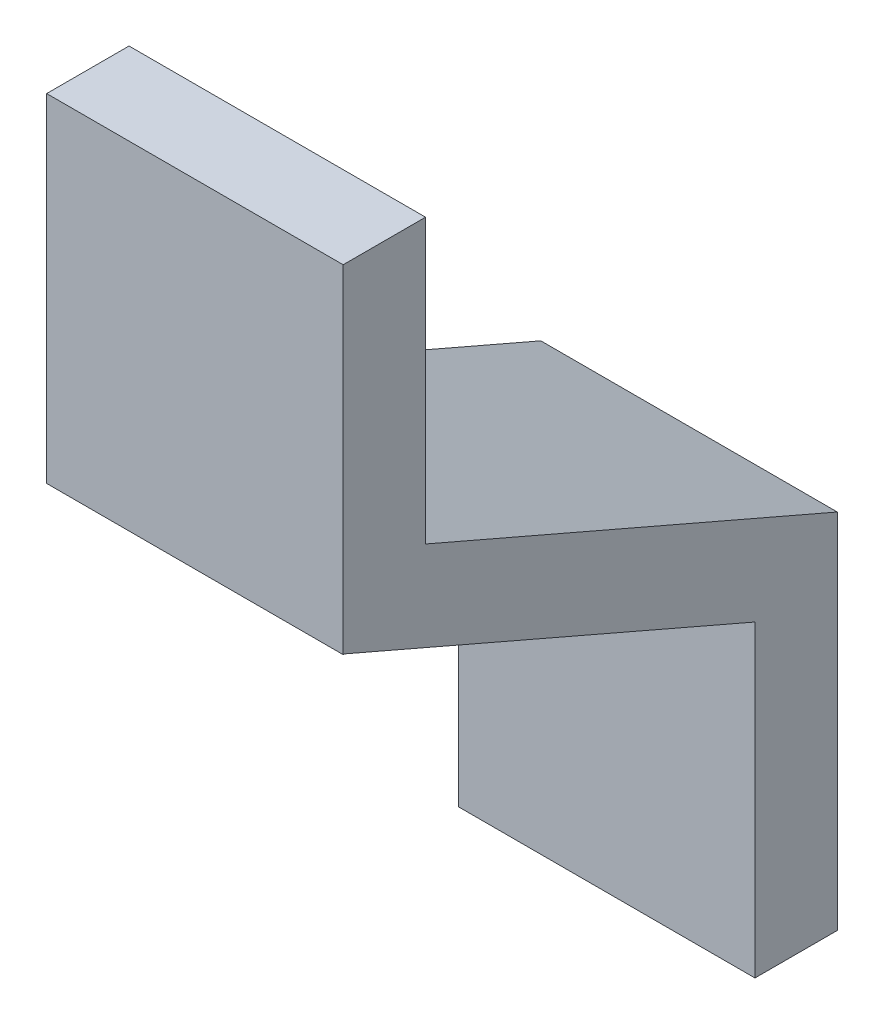
ISO-10303-21;
HEADER;
FILE_DESCRIPTION(('STEP AP214'),'2;1');
FILE_NAME('part.step','',(''),(''),'','','');
FILE_SCHEMA(('AUTOMOTIVE_DESIGN { 1 0 10303 214 1 1 1 1 }'));
ENDSEC;
DATA;
#1=APPLICATION_CONTEXT('core data for automotive mechanical design processes');
#2=APPLICATION_PROTOCOL_DEFINITION('international standard','automotive_design',2000,#1);
#3=PRODUCT_CONTEXT('',#1,'mechanical');
#4=PRODUCT('Part','Part','',(#3));
#5=PRODUCT_RELATED_PRODUCT_CATEGORY('part','',(#4));
#6=PRODUCT_DEFINITION_FORMATION('','',#4);
#7=PRODUCT_DEFINITION_CONTEXT('part definition',#1,'design');
#8=PRODUCT_DEFINITION('design','',#6,#7);
#9=PRODUCT_DEFINITION_SHAPE('','',#8);
#10=(LENGTH_UNIT() NAMED_UNIT(*) SI_UNIT(.MILLI.,.METRE.));
#11=(NAMED_UNIT(*) PLANE_ANGLE_UNIT() SI_UNIT($,.RADIAN.));
#12=(NAMED_UNIT(*) SI_UNIT($,.STERADIAN.) SOLID_ANGLE_UNIT());
#13=UNCERTAINTY_MEASURE_WITH_UNIT(LENGTH_MEASURE(1.E-05),#10,'distance_accuracy_value','');
#14=(GEOMETRIC_REPRESENTATION_CONTEXT(3) GLOBAL_UNCERTAINTY_ASSIGNED_CONTEXT((#13)) GLOBAL_UNIT_ASSIGNED_CONTEXT((#10,
#11,#12)) REPRESENTATION_CONTEXT('',''));
#15=CARTESIAN_POINT('',(0.,0.,0.));
#16=DIRECTION('',(0.,0.,1.));
#17=DIRECTION('',(1.,0.,0.));
#18=AXIS2_PLACEMENT_3D('',#15,#16,#17);
#19=CARTESIAN_POINT('',(7.42,0.999999996424,0.5));
#20=DIRECTION('',(0.,1.,0.));
#21=DIRECTION('',(0.,0.,1.));
#22=AXIS2_PLACEMENT_3D('',#19,#20,#21);
#23=PLANE('',#22);
#24=DIRECTION('',(1.,0.,0.));
#25=VECTOR('',#24,1.);
#26=CARTESIAN_POINT('',(7.42,0.999999996424,0.5));
#27=LINE('',#26,#25);
#28=CARTESIAN_POINT('',(7.780000014305,0.999999996424,0.5));
#29=VERTEX_POINT('',#28);
#30=CARTESIAN_POINT('',(7.42,0.999999996424,0.5));
#31=VERTEX_POINT('',#30);
#32=EDGE_CURVE('E140',#29,#31,#27,.F.);
#33=ORIENTED_EDGE('',*,*,#32,.T.);
#34=DIRECTION('',(0.,0.,-1.));
#35=VECTOR('',#34,1.);
#36=CARTESIAN_POINT('',(7.42,0.999999996424,0.));
#37=LINE('',#36,#35);
#38=CARTESIAN_POINT('',(7.42,0.999999996424,0.60000000149));
#39=VERTEX_POINT('',#38);
#40=EDGE_CURVE('E133',#31,#39,#37,.F.);
#41=ORIENTED_EDGE('',*,*,#40,.T.);
#42=DIRECTION('',(1.,0.,0.));
#43=VECTOR('',#42,1.);
#44=CARTESIAN_POINT('',(7.42,0.999999996424,0.60000000149));
#45=LINE('',#44,#43);
#46=CARTESIAN_POINT('',(7.780000014305,0.999999996424,0.60000000149));
#47=VERTEX_POINT('',#46);
#48=EDGE_CURVE('E129',#47,#39,#45,.F.);
#49=ORIENTED_EDGE('',*,*,#48,.F.);
#50=DIRECTION('',(0.,0.,-1.));
#51=VECTOR('',#50,1.);
#52=CARTESIAN_POINT('',(7.780000014305,0.999999996424,0.));
#53=LINE('',#52,#51);
#54=EDGE_CURVE('E106',#29,#47,#53,.F.);
#55=ORIENTED_EDGE('',*,*,#54,.F.);
#56=EDGE_LOOP('',(#33,#41,#49,#55));
#57=FACE_BOUND('',#56,.T.);
#58=ADVANCED_FACE('F17',(#57),#23,.T.);
#59=CARTESIAN_POINT('',(7.42,0.59,0.60000000149));
#60=DIRECTION('',(0.,0.,1.));
#61=DIRECTION('',(1.,0.,0.));
#62=AXIS2_PLACEMENT_3D('',#59,#60,#61);
#63=PLANE('',#62);
#64=DIRECTION('',(0.,1.,0.));
#65=VECTOR('',#64,1.);
#66=CARTESIAN_POINT('',(7.42,0.44,0.60000000149));
#67=LINE('',#66,#65);
#68=CARTESIAN_POINT('',(7.42,0.59,0.60000000149));
#69=VERTEX_POINT('',#68);
#70=EDGE_CURVE('E136',#39,#69,#67,.F.);
#71=ORIENTED_EDGE('',*,*,#70,.T.);
#72=DIRECTION('',(1.,0.,0.));
#73=VECTOR('',#72,1.);
#74=CARTESIAN_POINT('',(7.42,0.59,0.60000000149));
#75=LINE('',#74,#73);
#76=CARTESIAN_POINT('',(7.780000014305,0.59,0.60000000149));
#77=VERTEX_POINT('',#76);
#78=EDGE_CURVE('E92',#69,#77,#75,.T.);
#79=ORIENTED_EDGE('',*,*,#78,.T.);
#80=DIRECTION('',(0.,1.,0.));
#81=VECTOR('',#80,1.);
#82=CARTESIAN_POINT('',(7.780000014305,0.44,0.60000000149));
#83=LINE('',#82,#81);
#84=EDGE_CURVE('E73',#47,#77,#83,.F.);
#85=ORIENTED_EDGE('',*,*,#84,.F.);
#86=ORIENTED_EDGE('',*,*,#48,.T.);
#87=EDGE_LOOP('',(#71,#79,#85,#86));
#88=FACE_BOUND('',#87,.T.);
#89=ADVANCED_FACE('F285',(#88),#63,.T.);
#90=CARTESIAN_POINT('',(7.42,0.59,0.5));
#91=DIRECTION('',(0.,1.,0.));
#92=DIRECTION('',(0.,0.,1.));
#93=AXIS2_PLACEMENT_3D('',#90,#91,#92);
#94=PLANE('',#93);
#95=DIRECTION('',(1.,0.,0.));
#96=VECTOR('',#95,1.);
#97=CARTESIAN_POINT('',(7.42,0.590000000000416,0.59842599626982));
#98=LINE('',#97,#96);
#99=CARTESIAN_POINT('',(7.780000014305,0.590000000000104,0.598425996269911));
#100=VERTEX_POINT('',#99);
#101=CARTESIAN_POINT('',(7.42,0.590000000000104,0.59842599626991));
#102=VERTEX_POINT('',#101);
#103=EDGE_CURVE('E84',#100,#102,#98,.F.);
#104=ORIENTED_EDGE('',*,*,#103,.F.);
#105=DIRECTION('',(0.,0.,-1.));
#106=VECTOR('',#105,1.);
#107=CARTESIAN_POINT('',(7.780000014305,0.59,0.));
#108=LINE('',#107,#106);
#109=EDGE_CURVE('E20',#77,#100,#108,.T.);
#110=ORIENTED_EDGE('',*,*,#109,.F.);
#111=ORIENTED_EDGE('',*,*,#78,.F.);
#112=DIRECTION('',(0.,0.,1.));
#113=VECTOR('',#112,1.);
#114=CARTESIAN_POINT('',(7.42,0.59,0.5));
#115=LINE('',#114,#113);
#116=EDGE_CURVE('E87',#69,#102,#115,.F.);
#117=ORIENTED_EDGE('',*,*,#116,.T.);
#118=EDGE_LOOP('',(#104,#110,#111,#117));
#119=FACE_BOUND('',#118,.T.);
#120=ADVANCED_FACE('F85',(#119),#94,.F.);
#121=CARTESIAN_POINT('',(7.42,0.348224508223,0.03971472531736));
#122=DIRECTION('',(0.,-0.917754904098641,0.397147247255844));
#123=DIRECTION('',(0.,-0.397147247255844,-0.917754904098641));
#124=AXIS2_PLACEMENT_3D('',#121,#122,#123);
#125=PLANE('',#124);
#126=DIRECTION('',(0.,-0.397147247255413,-0.917754904098827));
#127=VECTOR('',#126,1.);
#128=CARTESIAN_POINT('',(7.780000014305,0.59,0.59842599627));
#129=LINE('',#128,#127);
#130=CARTESIAN_POINT('',(7.780000014305,0.37431222660502,0.10000000149));
#131=VERTEX_POINT('',#130);
#132=EDGE_CURVE('E80',#100,#131,#129,.T.);
#133=ORIENTED_EDGE('',*,*,#132,.F.);
#134=ORIENTED_EDGE('',*,*,#103,.T.);
#135=DIRECTION('',(0.,-0.397147247255413,-0.917754904098827));
#136=VECTOR('',#135,1.);
#137=CARTESIAN_POINT('',(7.42,0.59,0.59842599627));
#138=LINE('',#137,#136);
#139=CARTESIAN_POINT('',(7.42,0.374312226605,0.10000000149));
#140=VERTEX_POINT('',#139);
#141=EDGE_CURVE('E122',#102,#140,#138,.T.);
#142=ORIENTED_EDGE('',*,*,#141,.T.);
#143=DIRECTION('',(1.,0.,0.));
#144=VECTOR('',#143,1.);
#145=CARTESIAN_POINT('',(7.42,0.374312226605,0.10000000149));
#146=LINE('',#145,#144);
#147=EDGE_CURVE('E91',#131,#140,#146,.F.);
#148=ORIENTED_EDGE('',*,*,#147,.F.);
#149=EDGE_LOOP('',(#133,#134,#142,#148));
#150=FACE_BOUND('',#149,.T.);
#151=ADVANCED_FACE('F94',(#150),#125,.T.);
#152=CARTESIAN_POINT('',(7.42,0.,0.10000000149));
#153=DIRECTION('',(0.,0.,1.));
#154=DIRECTION('',(1.,0.,0.));
#155=AXIS2_PLACEMENT_3D('',#152,#153,#154);
#156=PLANE('',#155);
#157=ORIENTED_EDGE('',*,*,#147,.T.);
#158=DIRECTION('',(0.,1.,0.));
#159=VECTOR('',#158,1.);
#160=CARTESIAN_POINT('',(7.42,0.44,0.10000000149));
#161=LINE('',#160,#159);
#162=CARTESIAN_POINT('',(7.42,0.,0.10000000149));
#163=VERTEX_POINT('',#162);
#164=EDGE_CURVE('E118',#140,#163,#161,.F.);
#165=ORIENTED_EDGE('',*,*,#164,.T.);
#166=DIRECTION('',(1.,0.,0.));
#167=VECTOR('',#166,1.);
#168=CARTESIAN_POINT('',(7.42,0.,0.10000000149));
#169=LINE('',#168,#167);
#170=CARTESIAN_POINT('',(7.780000014305,0.,0.10000000149));
#171=VERTEX_POINT('',#170);
#172=EDGE_CURVE('E115',#163,#171,#169,.T.);
#173=ORIENTED_EDGE('',*,*,#172,.T.);
#174=DIRECTION('',(0.,1.,0.));
#175=VECTOR('',#174,1.);
#176=CARTESIAN_POINT('',(7.780000014305,0.44,0.10000000149));
#177=LINE('',#176,#175);
#178=EDGE_CURVE('E96',#131,#171,#177,.F.);
#179=ORIENTED_EDGE('',*,*,#178,.F.);
#180=EDGE_LOOP('',(#157,#165,#173,#179));
#181=FACE_BOUND('',#180,.T.);
#182=ADVANCED_FACE('F202',(#181),#156,.T.);
#183=CARTESIAN_POINT('',(7.42,0.,0.));
#184=DIRECTION('',(0.,1.,0.));
#185=DIRECTION('',(0.,0.,1.));
#186=AXIS2_PLACEMENT_3D('',#183,#184,#185);
#187=PLANE('',#186);
#188=DIRECTION('',(0.,0.,-1.));
#189=VECTOR('',#188,1.);
#190=CARTESIAN_POINT('',(7.42,0.,0.));
#191=LINE('',#190,#189);
#192=CARTESIAN_POINT('',(7.42,0.,0.));
#193=VERTEX_POINT('',#192);
#194=EDGE_CURVE('E121',#163,#193,#191,.T.);
#195=ORIENTED_EDGE('',*,*,#194,.T.);
#196=DIRECTION('',(1.,0.,0.));
#197=VECTOR('',#196,1.);
#198=CARTESIAN_POINT('',(7.42,0.,0.));
#199=LINE('',#198,#197);
#200=CARTESIAN_POINT('',(7.780000014305,0.,0.));
#201=VERTEX_POINT('',#200);
#202=EDGE_CURVE('E112',#193,#201,#199,.T.);
#203=ORIENTED_EDGE('',*,*,#202,.T.);
#204=DIRECTION('',(0.,0.,-1.));
#205=VECTOR('',#204,1.);
#206=CARTESIAN_POINT('',(7.780000014305,0.,0.));
#207=LINE('',#206,#205);
#208=EDGE_CURVE('E98',#171,#201,#207,.T.);
#209=ORIENTED_EDGE('',*,*,#208,.F.);
#210=ORIENTED_EDGE('',*,*,#172,.F.);
#211=EDGE_LOOP('',(#195,#203,#209,#210));
#212=FACE_BOUND('',#211,.T.);
#213=ADVANCED_FACE('F206',(#212),#187,.F.);
#214=CARTESIAN_POINT('',(7.42,0.,0.));
#215=DIRECTION('',(0.,0.,1.));
#216=DIRECTION('',(1.,0.,0.));
#217=AXIS2_PLACEMENT_3D('',#214,#215,#216);
#218=PLANE('',#217);
#219=ORIENTED_EDGE('',*,*,#202,.F.);
#220=DIRECTION('',(0.,1.,0.));
#221=VECTOR('',#220,1.);
#222=CARTESIAN_POINT('',(7.42,0.44,0.));
#223=LINE('',#222,#221);
#224=CARTESIAN_POINT('',(7.42,0.439999998997445,-1.94673175919965E-10));
#225=VERTEX_POINT('',#224);
#226=EDGE_CURVE('E178',#193,#225,#223,.T.);
#227=ORIENTED_EDGE('',*,*,#226,.T.);
#228=DIRECTION('',(1.,0.,0.));
#229=VECTOR('',#228,1.);
#230=CARTESIAN_POINT('',(7.42,0.43999999966303,-7.78692710220355E-10));
#231=LINE('',#230,#229);
#232=CARTESIAN_POINT('',(7.780000014305,0.439999998997445,-1.94673175919965E-10));
#233=VERTEX_POINT('',#232);
#234=EDGE_CURVE('E163',#225,#233,#231,.T.);
#235=ORIENTED_EDGE('',*,*,#234,.T.);
#236=DIRECTION('',(0.,1.,0.));
#237=VECTOR('',#236,1.);
#238=CARTESIAN_POINT('',(7.780000014305,0.44,0.));
#239=LINE('',#238,#237);
#240=EDGE_CURVE('E109',#201,#233,#239,.T.);
#241=ORIENTED_EDGE('',*,*,#240,.F.);
#242=EDGE_LOOP('',(#219,#227,#235,#241));
#243=FACE_BOUND('',#242,.T.);
#244=ADVANCED_FACE('F186',(#243),#218,.F.);
#245=CARTESIAN_POINT('',(7.780000014305,0.44,0.));
#246=DIRECTION('',(1.,0.,0.));
#247=DIRECTION('',(0.,0.,-1.));
#248=AXIS2_PLACEMENT_3D('',#245,#246,#247);
#249=PLANE('',#248);
#250=ORIENTED_EDGE('',*,*,#178,.T.);
#251=ORIENTED_EDGE('',*,*,#208,.T.);
#252=ORIENTED_EDGE('',*,*,#240,.T.);
#253=DIRECTION('',(0.,-0.397147247255844,-0.917754904098641));
#254=VECTOR('',#253,1.);
#255=CARTESIAN_POINT('',(7.780000014305,0.44,0.));
#256=LINE('',#255,#254);
#257=CARTESIAN_POINT('',(7.780000014305,0.656368904967003,0.499999999999999));
#258=VERTEX_POINT('',#257);
#259=EDGE_CURVE('E151',#233,#258,#256,.F.);
#260=ORIENTED_EDGE('',*,*,#259,.T.);
#261=DIRECTION('',(0.,1.,0.));
#262=VECTOR('',#261,1.);
#263=CARTESIAN_POINT('',(7.780000014305,0.59,0.5));
#264=LINE('',#263,#262);
#265=EDGE_CURVE('E144',#258,#29,#264,.T.);
#266=ORIENTED_EDGE('',*,*,#265,.T.);
#267=ORIENTED_EDGE('',*,*,#54,.T.);
#268=ORIENTED_EDGE('',*,*,#84,.T.);
#269=ORIENTED_EDGE('',*,*,#109,.T.);
#270=ORIENTED_EDGE('',*,*,#132,.T.);
#271=EDGE_LOOP('',(#250,#251,#252,#260,#266,#267,#268,#269,#270));
#272=FACE_BOUND('',#271,.T.);
#273=ADVANCED_FACE('F78',(#272),#249,.T.);
#274=CARTESIAN_POINT('',(7.42,0.59,0.5));
#275=DIRECTION('',(0.,0.,1.));
#276=DIRECTION('',(1.,0.,0.));
#277=AXIS2_PLACEMENT_3D('',#274,#275,#276);
#278=PLANE('',#277);
#279=ORIENTED_EDGE('',*,*,#265,.F.);
#280=DIRECTION('',(1.,0.,0.));
#281=VECTOR('',#280,1.);
#282=CARTESIAN_POINT('',(7.42,0.656368904967005,0.499999999999998));
#283=LINE('',#282,#281);
#284=CARTESIAN_POINT('',(7.42,0.656368904967001,0.5));
#285=VERTEX_POINT('',#284);
#286=EDGE_CURVE('E26',#258,#285,#283,.F.);
#287=ORIENTED_EDGE('',*,*,#286,.T.);
#288=DIRECTION('',(0.,1.,0.));
#289=VECTOR('',#288,1.);
#290=CARTESIAN_POINT('',(7.42,0.44,0.5));
#291=LINE('',#290,#289);
#292=EDGE_CURVE('E34',#285,#31,#291,.T.);
#293=ORIENTED_EDGE('',*,*,#292,.T.);
#294=ORIENTED_EDGE('',*,*,#32,.F.);
#295=EDGE_LOOP('',(#279,#287,#293,#294));
#296=FACE_BOUND('',#295,.T.);
#297=ADVANCED_FACE('F212',(#296),#278,.F.);
#298=CARTESIAN_POINT('',(7.42,0.44,0.));
#299=DIRECTION('',(1.,0.,0.));
#300=DIRECTION('',(0.,0.,-1.));
#301=AXIS2_PLACEMENT_3D('',#298,#299,#300);
#302=PLANE('',#301);
#303=ORIENTED_EDGE('',*,*,#226,.F.);
#304=ORIENTED_EDGE('',*,*,#194,.F.);
#305=ORIENTED_EDGE('',*,*,#164,.F.);
#306=ORIENTED_EDGE('',*,*,#141,.F.);
#307=ORIENTED_EDGE('',*,*,#116,.F.);
#308=ORIENTED_EDGE('',*,*,#70,.F.);
#309=ORIENTED_EDGE('',*,*,#40,.F.);
#310=ORIENTED_EDGE('',*,*,#292,.F.);
#311=DIRECTION('',(0.,-0.397147247255844,-0.917754904098641));
#312=VECTOR('',#311,1.);
#313=CARTESIAN_POINT('',(7.42,0.44,0.));
#314=LINE('',#313,#312);
#315=EDGE_CURVE('E11',#285,#225,#314,.T.);
#316=ORIENTED_EDGE('',*,*,#315,.T.);
#317=EDGE_LOOP('',(#303,#304,#305,#306,#307,#308,#309,#310,#316));
#318=FACE_BOUND('',#317,.T.);
#319=ADVANCED_FACE('F207',(#318),#302,.F.);
#320=CARTESIAN_POINT('',(7.42,0.44,0.));
#321=DIRECTION('',(0.,-0.917754904098641,0.397147247255844));
#322=DIRECTION('',(0.,-0.397147247255844,-0.917754904098641));
#323=AXIS2_PLACEMENT_3D('',#320,#321,#322);
#324=PLANE('',#323);
#325=ORIENTED_EDGE('',*,*,#286,.F.);
#326=ORIENTED_EDGE('',*,*,#259,.F.);
#327=ORIENTED_EDGE('',*,*,#234,.F.);
#328=ORIENTED_EDGE('',*,*,#315,.F.);
#329=EDGE_LOOP('',(#325,#326,#327,#328));
#330=FACE_BOUND('',#329,.T.);
#331=ADVANCED_FACE('F193',(#330),#324,.F.);
#332=CLOSED_SHELL('',(#58,#89,#120,#151,#182,#213,#244,#273,#297,#319,#331));
#333=MANIFOLD_SOLID_BREP('B1',#332);
#334=ADVANCED_BREP_SHAPE_REPRESENTATION('',(#18,#333),#14);
#335=SHAPE_DEFINITION_REPRESENTATION(#9,#334);
ENDSEC;
END-ISO-10303-21;
